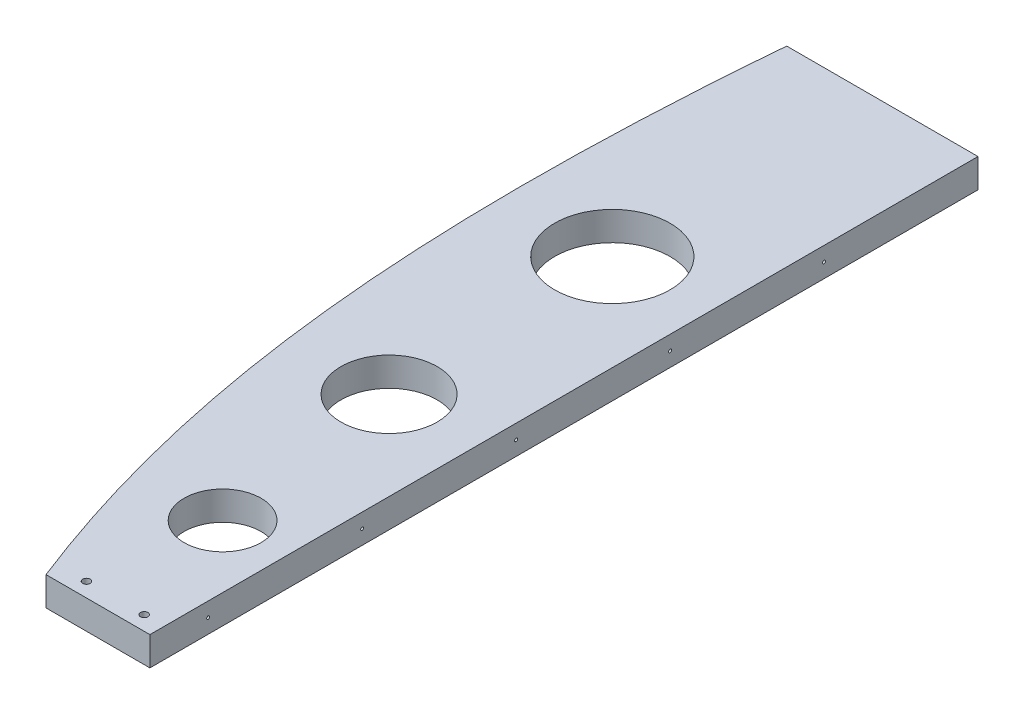
ISO-10303-21;
HEADER;
FILE_DESCRIPTION(('STEP AP214'),'2;1');
FILE_NAME('part.step','',(''),(''),'','','');
FILE_SCHEMA(('AUTOMOTIVE_DESIGN { 1 0 10303 214 1 1 1 1 }'));
ENDSEC;
DATA;
#1=APPLICATION_CONTEXT('core data for automotive mechanical design processes');
#2=APPLICATION_PROTOCOL_DEFINITION('international standard','automotive_design',2000,#1);
#3=PRODUCT_CONTEXT('',#1,'mechanical');
#4=PRODUCT('Part','Part','',(#3));
#5=PRODUCT_RELATED_PRODUCT_CATEGORY('part','',(#4));
#6=PRODUCT_DEFINITION_FORMATION('','',#4);
#7=PRODUCT_DEFINITION_CONTEXT('part definition',#1,'design');
#8=PRODUCT_DEFINITION('design','',#6,#7);
#9=PRODUCT_DEFINITION_SHAPE('','',#8);
#10=(LENGTH_UNIT() NAMED_UNIT(*) SI_UNIT(.MILLI.,.METRE.));
#11=(NAMED_UNIT(*) PLANE_ANGLE_UNIT() SI_UNIT($,.RADIAN.));
#12=(NAMED_UNIT(*) SI_UNIT($,.STERADIAN.) SOLID_ANGLE_UNIT());
#13=UNCERTAINTY_MEASURE_WITH_UNIT(LENGTH_MEASURE(1.E-05),#10,'distance_accuracy_value','');
#14=(GEOMETRIC_REPRESENTATION_CONTEXT(3) GLOBAL_UNCERTAINTY_ASSIGNED_CONTEXT((#13)) GLOBAL_UNIT_ASSIGNED_CONTEXT((#10,
#11,#12)) REPRESENTATION_CONTEXT('',''));
#15=CARTESIAN_POINT('',(0.,0.,0.));
#16=DIRECTION('',(0.,0.,1.));
#17=DIRECTION('',(1.,0.,0.));
#18=AXIS2_PLACEMENT_3D('',#15,#16,#17);
#19=CARTESIAN_POINT('',(-392.720476188398,5372.10000000001,2956.72721358892));
#20=DIRECTION('',(0.,1.,0.));
#21=DIRECTION('',(0.,0.,1.));
#22=AXIS2_PLACEMENT_3D('',#19,#20,#21);
#23=PLANE('',#22);
#24=CARTESIAN_POINT('',(-376.528681754696,5372.1,3220.41942707642));
#25=DIRECTION('',(0.,-1.,0.));
#26=DIRECTION('',(0.,0.,1.));
#27=AXIS2_PLACEMENT_3D('',#24,#25,#26);
#28=CIRCLE('',#27,2.45744999999997);
#29=CARTESIAN_POINT('',(-376.528681754696,5372.1,3222.87687707642));
#30=VERTEX_POINT('',#29);
#31=EDGE_CURVE('E437',#30,#30,#28,.T.);
#32=ORIENTED_EDGE('',*,*,#31,.F.);
#33=EDGE_LOOP('',(#32));
#34=FACE_BOUND('',#33,.T.);
#35=CARTESIAN_POINT('',(-338.428578956858,5372.1,3220.4194270765));
#36=DIRECTION('',(0.,-1.,0.));
#37=DIRECTION('',(0.,0.,1.));
#38=AXIS2_PLACEMENT_3D('',#35,#36,#37);
#39=CIRCLE('',#38,2.45744999999997);
#40=CARTESIAN_POINT('',(-338.428578956858,5372.1,3222.8768770765));
#41=VERTEX_POINT('',#40);
#42=EDGE_CURVE('E126',#41,#41,#39,.T.);
#43=ORIENTED_EDGE('',*,*,#42,.F.);
#44=EDGE_LOOP('',(#43));
#45=FACE_BOUND('',#44,.T.);
#46=CARTESIAN_POINT('',(-388.61999999999,5372.1,2861.31));
#47=DIRECTION('',(0.,-1.,0.));
#48=DIRECTION('',(1.,0.,0.));
#49=AXIS2_PLACEMENT_3D('',#46,#47,#48);
#50=CIRCLE('',#49,38.0999999999997);
#51=CARTESIAN_POINT('',(-350.51999999999,5372.1,2861.31));
#52=VERTEX_POINT('',#51);
#53=EDGE_CURVE('E166',#52,#52,#50,.T.);
#54=ORIENTED_EDGE('',*,*,#53,.F.);
#55=EDGE_LOOP('',(#54));
#56=FACE_BOUND('',#55,.T.);
#57=CARTESIAN_POINT('',(-383.53999999999,5372.1,3013.71));
#58=DIRECTION('',(0.,-1.,0.));
#59=DIRECTION('',(1.,0.,0.));
#60=AXIS2_PLACEMENT_3D('',#57,#58,#59);
#61=CIRCLE('',#60,31.75);
#62=CARTESIAN_POINT('',(-351.78999999999,5372.1,3013.71));
#63=VERTEX_POINT('',#62);
#64=EDGE_CURVE('E462',#63,#63,#61,.T.);
#65=ORIENTED_EDGE('',*,*,#64,.F.);
#66=EDGE_LOOP('',(#65));
#67=FACE_BOUND('',#66,.T.);
#68=CARTESIAN_POINT('',(-366.394999999991,5372.1,3140.71));
#69=DIRECTION('',(0.,-1.,0.));
#70=DIRECTION('',(1.,0.,0.));
#71=AXIS2_PLACEMENT_3D('',#68,#69,#70);
#72=CIRCLE('',#71,25.4);
#73=CARTESIAN_POINT('',(-340.994999999991,5372.1,3140.71));
#74=VERTEX_POINT('',#73);
#75=EDGE_CURVE('E179',#74,#74,#72,.T.);
#76=ORIENTED_EDGE('',*,*,#75,.F.);
#77=EDGE_LOOP('',(#76));
#78=FACE_BOUND('',#77,.T.);
#79=DIRECTION('',(0.,0.,1.));
#80=VECTOR('',#79,1.);
#81=CARTESIAN_POINT('',(-325.119999999999,5372.10000000001,2683.51));
#82=LINE('',#81,#80);
#83=CARTESIAN_POINT('',(-325.119999999999,5372.10000000001,2683.51));
#84=VERTEX_POINT('',#83);
#85=CARTESIAN_POINT('',(-325.119999999998,5372.1,3229.94442717783));
#86=VERTEX_POINT('',#85);
#87=EDGE_CURVE('E171',#84,#86,#82,.T.);
#88=ORIENTED_EDGE('',*,*,#87,.T.);
#89=DIRECTION('',(-1.,0.,0.));
#90=VECTOR('',#89,1.);
#91=CARTESIAN_POINT('',(-325.12,5372.1,3229.94442717783));
#92=LINE('',#91,#90);
#93=CARTESIAN_POINT('',(-393.682548612295,5372.1,3229.94442717783));
#94=VERTEX_POINT('',#93);
#95=EDGE_CURVE('E197',#86,#94,#92,.T.);
#96=ORIENTED_EDGE('',*,*,#95,.T.);
#97=CARTESIAN_POINT('',(-393.682548612295,5372.1,3229.94442717783));
#98=CARTESIAN_POINT('',(-394.456887278259,5372.10000000001,3227.97409267507));
#99=CARTESIAN_POINT('',(-395.224418386657,5372.10000000001,3226.00108202925));
#100=CARTESIAN_POINT('',(-396.745699742085,5372.10000000001,3222.04984801669));
#101=CARTESIAN_POINT('',(-397.499450552642,5372.10000000001,3220.07162486692));
#102=CARTESIAN_POINT('',(-398.993053269481,5372.10000000001,3216.10998577864));
#103=CARTESIAN_POINT('',(-399.732905469335,5372.10000000001,3214.12656995082));
#104=CARTESIAN_POINT('',(-401.198834415246,5372.10000000001,3210.1539474909));
#105=CARTESIAN_POINT('',(-401.924906766049,5372.10000000001,3208.16473923706));
#106=CARTESIAN_POINT('',(-403.362939318136,5372.10000000001,3204.18117724008));
#107=CARTESIAN_POINT('',(-404.074899215256,5372.10000000001,3202.18682338709));
#108=CARTESIAN_POINT('',(-405.484616665226,5372.10000000001,3198.19301213818));
#109=CARTESIAN_POINT('',(-406.182373587811,5372.1,3196.19355452019));
#110=CARTESIAN_POINT('',(-408.953173030685,5372.09999999999,3188.16137490409));
#111=CARTESIAN_POINT('',(-410.968400672618,5372.1,3182.10857083572));
#112=CARTESIAN_POINT('',(-414.867042059986,5372.10000000001,3169.9598314745));
#113=CARTESIAN_POINT('',(-416.750437957192,5372.10000000001,3163.86389046404));
#114=CARTESIAN_POINT('',(-420.384172507283,5372.10000000001,3151.63202096788));
#115=CARTESIAN_POINT('',(-422.134502345279,5372.10000000001,3145.49608986225));
#116=CARTESIAN_POINT('',(-425.501734798347,5372.10000000001,3133.18776982584));
#117=CARTESIAN_POINT('',(-427.118638031933,5372.10000000001,3127.01538106421));
#118=CARTESIAN_POINT('',(-430.22028975762,5372.10000000001,3114.6349025104));
#119=CARTESIAN_POINT('',(-431.704985678232,5372.10000000001,3108.42679955208));
#120=CARTESIAN_POINT('',(-434.542919092932,5372.10000000001,3095.98083496866));
#121=CARTESIAN_POINT('',(-435.896160515652,5372.10000000001,3089.74297423873));
#122=CARTESIAN_POINT('',(-438.473419996918,5372.10000000001,3077.24069251174));
#123=CARTESIAN_POINT('',(-439.697439319747,5372.10000000001,3070.97627177516));
#124=CARTESIAN_POINT('',(-442.019093536704,5372.10000000001,3058.4242371645));
#125=CARTESIAN_POINT('',(-443.11673095758,5372.1,3052.1366237567));
#126=CARTESIAN_POINT('',(-445.531902422019,5372.1,3037.45725662658));
#127=CARTESIAN_POINT('',(-446.802022602098,5372.10000000001,3029.05767164538));
#128=CARTESIAN_POINT('',(-449.133660073006,5372.10000000001,3012.22966620934));
#129=CARTESIAN_POINT('',(-450.195175381902,5372.10000000001,3003.80124548132));
#130=CARTESIAN_POINT('',(-452.119865470587,5372.10000000001,2986.92177852863));
#131=CARTESIAN_POINT('',(-452.98303844059,5372.10000000001,2978.47073209822));
#132=CARTESIAN_POINT('',(-454.521823137449,5372.10000000001,2961.55244648694));
#133=CARTESIAN_POINT('',(-455.197451604684,5372.10000000001,2953.08520881928));
#134=CARTESIAN_POINT('',(-456.37239496728,5372.10000000001,2936.13867906095));
#135=CARTESIAN_POINT('',(-456.871712957137,5372.10000000001,2927.65938718446));
#136=CARTESIAN_POINT('',(-457.496824621888,5372.10000000001,2914.93467998271));
#137=CARTESIAN_POINT('',(-457.684549513377,5372.10000000001,2910.69219806393));
#138=CARTESIAN_POINT('',(-458.020084952673,5372.10000000001,2902.20564766661));
#139=CARTESIAN_POINT('',(-458.167895578349,5372.1,2897.96157919117));
#140=CARTESIAN_POINT('',(-458.39261386685,5372.1,2890.54167375211));
#141=CARTESIAN_POINT('',(-458.478002740262,5372.10000000001,2887.36608909858));
#142=CARTESIAN_POINT('',(-458.627415596338,5372.10000000001,2881.01442207913));
#143=CARTESIAN_POINT('',(-458.691439622968,5372.10000000001,2877.83833971425));
#144=CARTESIAN_POINT('',(-458.798866254696,5372.10000000001,2871.48592736605));
#145=CARTESIAN_POINT('',(-458.842269506909,5372.10000000001,2868.30959739364));
#146=CARTESIAN_POINT('',(-458.909067808654,5372.10000000001,2861.95672988344));
#147=CARTESIAN_POINT('',(-458.9324628449,5372.10000000001,2858.78019234552));
#148=CARTESIAN_POINT('',(-458.973523832036,5372.10000000001,2849.25164706475));
#149=CARTESIAN_POINT('',(-458.962085713268,5372.10000000001,2842.8994936941));
#150=CARTESIAN_POINT('',(-458.865746069072,5372.10000000001,2830.19568475043));
#151=CARTESIAN_POINT('',(-458.780843498029,5372.1,2823.84402918579));
#152=CARTESIAN_POINT('',(-458.555440423178,5372.1,2811.90254793619));
#153=CARTESIAN_POINT('',(-458.422814807488,5372.10000000001,2806.31257153562));
#154=CARTESIAN_POINT('',(-458.105397741389,5372.10000000001,2795.13403521731));
#155=CARTESIAN_POINT('',(-457.920605650511,5372.10000000001,2789.54547531779));
#156=CARTESIAN_POINT('',(-457.500586546639,5372.10000000001,2778.37016686811));
#157=CARTESIAN_POINT('',(-457.265358727711,5372.10000000001,2772.78341834832));
#158=CARTESIAN_POINT('',(-456.745902375996,5372.10000000001,2761.61213595354));
#159=CARTESIAN_POINT('',(-456.461673251713,5372.10000000001,2756.0276021061));
#160=CARTESIAN_POINT('',(-455.845303056686,5372.10000000001,2744.86008184125));
#161=CARTESIAN_POINT('',(-455.513152591962,5372.10000000001,2739.27709594277));
#162=CARTESIAN_POINT('',(-454.801842865255,5372.10000000001,2728.11418570015));
#163=CARTESIAN_POINT('',(-454.422684125742,5372.10000000001,2722.53426132267));
#164=CARTESIAN_POINT('',(-453.617925963618,5372.10000000001,2711.3779283249));
#165=CARTESIAN_POINT('',(-453.192327964683,5372.10000000001,2705.80151960209));
#166=CARTESIAN_POINT('',(-452.519277338354,5372.10000000001,2697.4398551389));
#167=CARTESIAN_POINT('',(-452.289157668394,5372.10000000001,2694.65319423764));
#168=CARTESIAN_POINT('',(-451.817351920111,5372.10000000001,2689.08085188907));
#169=CARTESIAN_POINT('',(-451.5756658423,5372.10000000001,2686.29517044172));
#170=CARTESIAN_POINT('',(-451.328190233736,5372.10000000001,2683.51));
#171=B_SPLINE_CURVE_WITH_KNOTS('',3,(#97,#98,#99,#100,#101,#102,#103,#104,#105,#106,#107,#108,
#109,#110,#111,#112,#113,#114,#115,#116,#117,#118,#119,#120,#121,#122,#123,#124,#125,#126,#127,
#128,#129,#130,#131,#132,#133,#134,#135,#136,#137,#138,#139,#140,#141,#142,#143,#144,#145,#146,
#147,#148,#149,#150,#151,#152,#153,#154,#155,#156,#157,#158,#159,#160,#161,#162,#163,#164,#165,
#166,#167,#168,#169,#170),.UNSPECIFIED.,.F.,.F.,(4,2,2,2,2,2,2,2,2,2,2,2,2,2,2,2,2,2,2,2,2,2,2,
2,2,2,2,2,2,2,2,2,2,2,2,2,4),(0.,6.3510800999696,12.7018998972633,19.0525853991757,
25.4052635958807,31.7580785621484,38.1111748266914,57.2478936892731,76.387198412672,
95.5277699060871,114.66825266624,133.816312856681,152.963800614741,172.111101020311,
191.258018548431,216.74035075125,242.222925047359,267.705731851514,293.186263306885,
318.666347521117,331.40609726997,344.145822164442,353.675953643452,363.206065510394,
372.735878286334,382.265697390112,401.3216964695,420.377966775741,437.152367296033,
453.926973771488,470.701848315527,487.476925363986,504.255295296114,521.033478762763,
537.811148008956,546.199566113042,554.587983845862),.UNSPECIFIED.);
#172=CARTESIAN_POINT('',(-451.328190233736,5372.10000000001,2683.51));
#173=VERTEX_POINT('',#172);
#174=EDGE_CURVE('E184',#94,#173,#171,.T.);
#175=ORIENTED_EDGE('',*,*,#174,.T.);
#176=DIRECTION('',(1.,0.,0.));
#177=VECTOR('',#176,1.);
#178=CARTESIAN_POINT('',(-451.328190233736,5372.10000000001,2683.51));
#179=LINE('',#178,#177);
#180=EDGE_CURVE('E172',#173,#84,#179,.T.);
#181=ORIENTED_EDGE('',*,*,#180,.T.);
#182=EDGE_LOOP('',(#88,#96,#175,#181));
#183=FACE_BOUND('',#182,.T.);
#184=ADVANCED_FACE('F47',(#34,#45,#56,#67,#78,#183),#23,.F.);
#185=CARTESIAN_POINT('',(-325.12,5372.1,3229.94442717783));
#186=DIRECTION('',(0.,0.,1.));
#187=DIRECTION('',(-1.,0.,0.));
#188=AXIS2_PLACEMENT_3D('',#185,#186,#187);
#189=PLANE('',#188);
#190=DIRECTION('',(-1.,0.,0.));
#191=VECTOR('',#190,1.);
#192=CARTESIAN_POINT('',(-392.720476188398,5391.15,3229.94442717783));
#193=LINE('',#192,#191);
#194=CARTESIAN_POINT('',(-325.119999999998,5391.15,3229.94442717783));
#195=VERTEX_POINT('',#194);
#196=CARTESIAN_POINT('',(-393.682548612295,5391.15,3229.94442717783));
#197=VERTEX_POINT('',#196);
#198=EDGE_CURVE('E164',#195,#197,#193,.T.);
#199=ORIENTED_EDGE('',*,*,#198,.T.);
#200=DIRECTION('',(0.,-1.,0.));
#201=VECTOR('',#200,1.);
#202=CARTESIAN_POINT('',(-393.682548612297,5381.625,3229.94442717783));
#203=LINE('',#202,#201);
#204=EDGE_CURVE('E92',#197,#94,#203,.T.);
#205=ORIENTED_EDGE('',*,*,#204,.T.);
#206=ORIENTED_EDGE('',*,*,#95,.F.);
#207=DIRECTION('',(0.,1.,0.));
#208=VECTOR('',#207,1.);
#209=CARTESIAN_POINT('',(-325.12,5372.1,3229.94442717783));
#210=LINE('',#209,#208);
#211=EDGE_CURVE('E180',#86,#195,#210,.T.);
#212=ORIENTED_EDGE('',*,*,#211,.T.);
#213=EDGE_LOOP('',(#199,#205,#206,#212));
#214=FACE_BOUND('',#213,.T.);
#215=ADVANCED_FACE('F242',(#214),#189,.T.);
#216=CARTESIAN_POINT('',(-393.682548612295,5372.1,3229.94442717783));
#217=CARTESIAN_POINT('',(-393.682548612295,5391.15,3229.94442717783));
#218=CARTESIAN_POINT('',(-433.14097239304,5372.10000000001,3129.54068836821));
#219=CARTESIAN_POINT('',(-433.140972393041,5391.15000000001,3129.54068836821));
#220=CARTESIAN_POINT('',(-454.834742459102,5372.1,3022.43692802554));
#221=CARTESIAN_POINT('',(-454.834742459102,5391.15,3022.43692802554));
#222=CARTESIAN_POINT('',(-460.312828518179,5372.1,2819.19788970161));
#223=CARTESIAN_POINT('',(-460.312828518179,5391.15,2819.19788970161));
#224=CARTESIAN_POINT('',(-457.003208667205,5372.1,2747.37762040659));
#225=CARTESIAN_POINT('',(-457.003208667205,5391.15,2747.37762040659));
#226=CARTESIAN_POINT('',(-451.328190233736,5372.10000000001,2683.51));
#227=CARTESIAN_POINT('',(-451.328190233736,5391.15000000001,2683.51));
#228=B_SPLINE_SURFACE_WITH_KNOTS('',3,1,((#216,#217),(#218,#219),(#220,#221),(#222,#223),(#224,
#225),(#226,#227)),.UNSPECIFIED.,.F.,.F.,.F.,(4,2,4),(2,2),(-54.2493510406912,-24.5787816023228,
-9.05068072297407),(0.,1.90499999999997),.UNSPECIFIED.);
#229=CARTESIAN_POINT('',(-393.682548612295,5391.15,3229.94442717783));
#230=CARTESIAN_POINT('',(-394.456887278259,5391.15000000001,3227.97409267507));
#231=CARTESIAN_POINT('',(-395.224418386657,5391.15000000001,3226.00108202925));
#232=CARTESIAN_POINT('',(-396.745699742085,5391.15000000001,3222.0498480167));
#233=CARTESIAN_POINT('',(-397.499450552642,5391.15000000001,3220.07162486693));
#234=CARTESIAN_POINT('',(-398.993053269482,5391.15000000001,3216.10998577864));
#235=CARTESIAN_POINT('',(-399.732905469335,5391.15000000001,3214.12656995082));
#236=CARTESIAN_POINT('',(-401.198834415246,5391.15000000001,3210.1539474909));
#237=CARTESIAN_POINT('',(-401.924906766049,5391.15000000001,3208.16473923706));
#238=CARTESIAN_POINT('',(-403.362939318136,5391.15000000001,3204.18117724009));
#239=CARTESIAN_POINT('',(-404.074899215256,5391.15000000001,3202.18682338709));
#240=CARTESIAN_POINT('',(-405.484616665227,5391.15000000001,3198.19301213818));
#241=CARTESIAN_POINT('',(-406.182373587811,5391.15,3196.1935545202));
#242=CARTESIAN_POINT('',(-408.953173030686,5391.14999999999,3188.16137490409));
#243=CARTESIAN_POINT('',(-410.968400672618,5391.15000000001,3182.10857083572));
#244=CARTESIAN_POINT('',(-414.867042059986,5391.15000000001,3169.9598314745));
#245=CARTESIAN_POINT('',(-416.750437957192,5391.15000000001,3163.86389046404));
#246=CARTESIAN_POINT('',(-420.384172507283,5391.15000000001,3151.63202096789));
#247=CARTESIAN_POINT('',(-422.134502345279,5391.15000000001,3145.49608986225));
#248=CARTESIAN_POINT('',(-425.501734798347,5391.15000000001,3133.18776982584));
#249=CARTESIAN_POINT('',(-427.118638031933,5391.15000000001,3127.01538106421));
#250=CARTESIAN_POINT('',(-430.220289757621,5391.15000000001,3114.6349025104));
#251=CARTESIAN_POINT('',(-431.704985678232,5391.15000000001,3108.42679955208));
#252=CARTESIAN_POINT('',(-434.542919092932,5391.15000000001,3095.98083496866));
#253=CARTESIAN_POINT('',(-435.896160515652,5391.15000000001,3089.74297423873));
#254=CARTESIAN_POINT('',(-438.473419996918,5391.15000000001,3077.24069251174));
#255=CARTESIAN_POINT('',(-439.697439319747,5391.15000000001,3070.97627177516));
#256=CARTESIAN_POINT('',(-442.019093536705,5391.15000000001,3058.42423716449));
#257=CARTESIAN_POINT('',(-443.116730957581,5391.15,3052.1366237567));
#258=CARTESIAN_POINT('',(-445.53190242202,5391.15,3037.45725662658));
#259=CARTESIAN_POINT('',(-446.802022602099,5391.15000000001,3029.05767164538));
#260=CARTESIAN_POINT('',(-449.133660073006,5391.15000000001,3012.22966620934));
#261=CARTESIAN_POINT('',(-450.195175381901,5391.15000000001,3003.80124548132));
#262=CARTESIAN_POINT('',(-452.119865470587,5391.15000000001,2986.92177852863));
#263=CARTESIAN_POINT('',(-452.98303844059,5391.15000000001,2978.47073209822));
#264=CARTESIAN_POINT('',(-454.521823137448,5391.15000000001,2961.55244648694));
#265=CARTESIAN_POINT('',(-455.197451604683,5391.15000000001,2953.08520881929));
#266=CARTESIAN_POINT('',(-456.37239496728,5391.15000000001,2936.13867906095));
#267=CARTESIAN_POINT('',(-456.871712957137,5391.15000000001,2927.65938718446));
#268=CARTESIAN_POINT('',(-457.496824621887,5391.15000000001,2914.93467998271));
#269=CARTESIAN_POINT('',(-457.684549513377,5391.15000000001,2910.69219806393));
#270=CARTESIAN_POINT('',(-458.020084952673,5391.15000000001,2902.20564766661));
#271=CARTESIAN_POINT('',(-458.167895578347,5391.15,2897.96157919117));
#272=CARTESIAN_POINT('',(-458.392613866848,5391.15,2890.54167375211));
#273=CARTESIAN_POINT('',(-458.478002740261,5391.15000000001,2887.36608909858));
#274=CARTESIAN_POINT('',(-458.627415596337,5391.15000000001,2881.01442207913));
#275=CARTESIAN_POINT('',(-458.691439622968,5391.15000000001,2877.83833971425));
#276=CARTESIAN_POINT('',(-458.798866254696,5391.15000000001,2871.48592736605));
#277=CARTESIAN_POINT('',(-458.842269506908,5391.15000000001,2868.30959739364));
#278=CARTESIAN_POINT('',(-458.909067808653,5391.15000000001,2861.95672988344));
#279=CARTESIAN_POINT('',(-458.9324628449,5391.15000000001,2858.78019234552));
#280=CARTESIAN_POINT('',(-458.973523832035,5391.15000000001,2849.25164706475));
#281=CARTESIAN_POINT('',(-458.962085713268,5391.15000000001,2842.8994936941));
#282=CARTESIAN_POINT('',(-458.865746069071,5391.15000000001,2830.19568475043));
#283=CARTESIAN_POINT('',(-458.780843498028,5391.15,2823.8440291858));
#284=CARTESIAN_POINT('',(-458.555440423177,5391.15,2811.90254793619));
#285=CARTESIAN_POINT('',(-458.422814807487,5391.15000000001,2806.31257153562));
#286=CARTESIAN_POINT('',(-458.105397741389,5391.15000000001,2795.13403521731));
#287=CARTESIAN_POINT('',(-457.920605650511,5391.15000000001,2789.54547531779));
#288=CARTESIAN_POINT('',(-457.500586546639,5391.15000000001,2778.37016686811));
#289=CARTESIAN_POINT('',(-457.265358727711,5391.15000000001,2772.78341834832));
#290=CARTESIAN_POINT('',(-456.745902375996,5391.15000000001,2761.61213595354));
#291=CARTESIAN_POINT('',(-456.461673251713,5391.15000000001,2756.0276021061));
#292=CARTESIAN_POINT('',(-455.845303056686,5391.15000000001,2744.86008184125));
#293=CARTESIAN_POINT('',(-455.513152591962,5391.15000000001,2739.27709594277));
#294=CARTESIAN_POINT('',(-454.801842865254,5391.15000000001,2728.11418570015));
#295=CARTESIAN_POINT('',(-454.422684125742,5391.15000000001,2722.53426132267));
#296=CARTESIAN_POINT('',(-453.617925963618,5391.15000000001,2711.3779283249));
#297=CARTESIAN_POINT('',(-453.192327964683,5391.15000000001,2705.80151960208));
#298=CARTESIAN_POINT('',(-452.519277338354,5391.15000000001,2697.4398551389));
#299=CARTESIAN_POINT('',(-452.289157668393,5391.15000000001,2694.65319423764));
#300=CARTESIAN_POINT('',(-451.817351920111,5391.15000000001,2689.08085188907));
#301=CARTESIAN_POINT('',(-451.5756658423,5391.15000000001,2686.29517044172));
#302=CARTESIAN_POINT('',(-451.328190233736,5391.15000000001,2683.51));
#303=B_SPLINE_CURVE_WITH_KNOTS('',3,(#229,#230,#231,#232,#233,#234,#235,#236,#237,#238,#239,
#240,#241,#242,#243,#244,#245,#246,#247,#248,#249,#250,#251,#252,#253,#254,#255,#256,#257,#258,
#259,#260,#261,#262,#263,#264,#265,#266,#267,#268,#269,#270,#271,#272,#273,#274,#275,#276,#277,
#278,#279,#280,#281,#282,#283,#284,#285,#286,#287,#288,#289,#290,#291,#292,#293,#294,#295,#296,
#297,#298,#299,#300,#301,#302),.UNSPECIFIED.,.F.,.F.,(4,2,2,2,2,2,2,2,2,2,2,2,2,2,2,2,2,2,2,2,2,
2,2,2,2,2,2,2,2,2,2,2,2,2,2,2,4),(0.,6.35108009996999,12.7018998972633,19.0525853991763,
25.405263595881,31.7580785621488,38.1111748266919,57.247893689274,76.3871984126733,
95.5277699060879,114.668252666242,133.816312856684,152.963800614743,172.111101020314,
191.258018548434,216.740350751253,242.22292504736,267.705731851516,293.186263306887,
318.666347521119,331.406097269971,344.145822164443,353.675953643454,363.206065510395,
372.735878286335,382.265697390113,401.321696469502,420.377966775743,437.152367296035,
453.92697377149,470.701848315529,487.476925363988,504.255295296116,521.033478762765,
537.811148008959,546.199566113044,554.587983845864),.UNSPECIFIED.);
#304=CARTESIAN_POINT('',(-451.328190233736,5391.15000000001,2683.51));
#305=VERTEX_POINT('',#304);
#306=EDGE_CURVE('E161',#197,#305,#303,.T.);
#307=DIRECTION('',(0.,1.,0.));
#308=VECTOR('',#307,1.);
#309=CARTESIAN_POINT('',(-451.328190233736,5372.10000000001,2683.51));
#310=LINE('',#309,#308);
#311=EDGE_CURVE('E169',#305,#173,#310,.F.);
#312=ORIENTED_EDGE('',*,*,#306,.T.);
#313=ORIENTED_EDGE('',*,*,#311,.T.);
#314=ORIENTED_EDGE('',*,*,#174,.F.);
#315=ORIENTED_EDGE('',*,*,#204,.F.);
#316=EDGE_LOOP('',(#312,#313,#314,#315));
#317=FACE_BOUND('',#316,.T.);
#318=ADVANCED_FACE('F49',(#317),#228,.F.);
#319=CARTESIAN_POINT('',(-451.328190233736,5372.10000000001,2683.51));
#320=DIRECTION('',(0.,0.,-1.));
#321=DIRECTION('',(1.,0.,0.));
#322=AXIS2_PLACEMENT_3D('',#319,#320,#321);
#323=PLANE('',#322);
#324=CARTESIAN_POINT('',(-419.531342480863,5381.62500000001,2683.51));
#325=DIRECTION('',(0.,0.,1.));
#326=DIRECTION('',(1.,0.,0.));
#327=AXIS2_PLACEMENT_3D('',#324,#325,#326);
#328=CIRCLE('',#327,0.991870000000006);
#329=CARTESIAN_POINT('',(-418.539472480863,5381.62500000001,2683.51));
#330=VERTEX_POINT('',#329);
#331=EDGE_CURVE('E153',#330,#330,#328,.T.);
#332=ORIENTED_EDGE('',*,*,#331,.T.);
#333=EDGE_LOOP('',(#332));
#334=FACE_BOUND('',#333,.T.);
#335=CARTESIAN_POINT('',(-356.590447493622,5381.62500000001,2683.51));
#336=DIRECTION('',(0.,0.,1.));
#337=DIRECTION('',(1.,0.,0.));
#338=AXIS2_PLACEMENT_3D('',#335,#336,#337);
#339=CIRCLE('',#338,0.991870000000006);
#340=CARTESIAN_POINT('',(-355.598577493622,5381.62500000001,2683.51));
#341=VERTEX_POINT('',#340);
#342=EDGE_CURVE('E157',#341,#341,#339,.T.);
#343=ORIENTED_EDGE('',*,*,#342,.T.);
#344=EDGE_LOOP('',(#343));
#345=FACE_BOUND('',#344,.T.);
#346=DIRECTION('',(-1.,0.,0.));
#347=VECTOR('',#346,1.);
#348=CARTESIAN_POINT('',(-392.720476188398,5391.15000000001,2683.51));
#349=LINE('',#348,#347);
#350=CARTESIAN_POINT('',(-325.119999999998,5391.15000000001,2683.51));
#351=VERTEX_POINT('',#350);
#352=EDGE_CURVE('E158',#305,#351,#349,.F.);
#353=ORIENTED_EDGE('',*,*,#352,.T.);
#354=DIRECTION('',(0.,1.,0.));
#355=VECTOR('',#354,1.);
#356=CARTESIAN_POINT('',(-325.119999999999,5372.10000000001,2683.51));
#357=LINE('',#356,#355);
#358=EDGE_CURVE('E177',#351,#84,#357,.F.);
#359=ORIENTED_EDGE('',*,*,#358,.T.);
#360=ORIENTED_EDGE('',*,*,#180,.F.);
#361=ORIENTED_EDGE('',*,*,#311,.F.);
#362=EDGE_LOOP('',(#353,#359,#360,#361));
#363=FACE_BOUND('',#362,.T.);
#364=ADVANCED_FACE('F237',(#334,#345,#363),#323,.T.);
#365=CARTESIAN_POINT('',(-325.119999999999,5372.10000000001,2683.51));
#366=DIRECTION('',(1.,0.,0.));
#367=DIRECTION('',(0.,0.,1.));
#368=AXIS2_PLACEMENT_3D('',#365,#366,#367);
#369=PLANE('',#368);
#370=CARTESIAN_POINT('',(-325.119999999997,5381.625,2785.11));
#371=DIRECTION('',(-1.,0.,0.));
#372=DIRECTION('',(0.,0.,1.));
#373=AXIS2_PLACEMENT_3D('',#370,#371,#372);
#374=CIRCLE('',#373,0.991870000000006);
#375=CARTESIAN_POINT('',(-325.119999999997,5381.625,2786.10187));
#376=VERTEX_POINT('',#375);
#377=EDGE_CURVE('E54',#376,#376,#374,.T.);
#378=ORIENTED_EDGE('',*,*,#377,.T.);
#379=EDGE_LOOP('',(#378));
#380=FACE_BOUND('',#379,.T.);
#381=CARTESIAN_POINT('',(-325.12,5381.625,2886.71));
#382=DIRECTION('',(-1.,0.,0.));
#383=DIRECTION('',(0.,0.,1.));
#384=AXIS2_PLACEMENT_3D('',#381,#382,#383);
#385=CIRCLE('',#384,0.991870000000006);
#386=CARTESIAN_POINT('',(-325.12,5381.625,2887.70187));
#387=VERTEX_POINT('',#386);
#388=EDGE_CURVE('E137',#387,#387,#385,.T.);
#389=ORIENTED_EDGE('',*,*,#388,.T.);
#390=EDGE_LOOP('',(#389));
#391=FACE_BOUND('',#390,.T.);
#392=CARTESIAN_POINT('',(-325.119999999999,5381.625,2988.31));
#393=DIRECTION('',(-1.,0.,0.));
#394=DIRECTION('',(0.,0.,1.));
#395=AXIS2_PLACEMENT_3D('',#392,#393,#394);
#396=CIRCLE('',#395,0.991870000000006);
#397=CARTESIAN_POINT('',(-325.119999999999,5381.625,2989.30187));
#398=VERTEX_POINT('',#397);
#399=EDGE_CURVE('E141',#398,#398,#396,.T.);
#400=ORIENTED_EDGE('',*,*,#399,.T.);
#401=EDGE_LOOP('',(#400));
#402=FACE_BOUND('',#401,.T.);
#403=CARTESIAN_POINT('',(-325.119999999999,5381.62500000001,3089.91));
#404=DIRECTION('',(-1.,0.,0.));
#405=DIRECTION('',(0.,0.,1.));
#406=AXIS2_PLACEMENT_3D('',#403,#404,#405);
#407=CIRCLE('',#406,0.991870000000006);
#408=CARTESIAN_POINT('',(-325.119999999999,5381.62500000001,3090.90187));
#409=VERTEX_POINT('',#408);
#410=EDGE_CURVE('E145',#409,#409,#407,.T.);
#411=ORIENTED_EDGE('',*,*,#410,.T.);
#412=EDGE_LOOP('',(#411));
#413=FACE_BOUND('',#412,.T.);
#414=CARTESIAN_POINT('',(-325.119999999999,5381.625,3191.51));
#415=DIRECTION('',(-1.,0.,0.));
#416=DIRECTION('',(0.,0.,1.));
#417=AXIS2_PLACEMENT_3D('',#414,#415,#416);
#418=CIRCLE('',#417,0.991870000000006);
#419=CARTESIAN_POINT('',(-325.119999999999,5381.625,3192.50187));
#420=VERTEX_POINT('',#419);
#421=EDGE_CURVE('E149',#420,#420,#418,.T.);
#422=ORIENTED_EDGE('',*,*,#421,.T.);
#423=EDGE_LOOP('',(#422));
#424=FACE_BOUND('',#423,.T.);
#425=DIRECTION('',(0.,0.,1.));
#426=VECTOR('',#425,1.);
#427=CARTESIAN_POINT('',(-325.119999999998,5391.15000000001,2956.72721358892));
#428=LINE('',#427,#426);
#429=EDGE_CURVE('E69',#351,#195,#428,.T.);
#430=ORIENTED_EDGE('',*,*,#429,.T.);
#431=ORIENTED_EDGE('',*,*,#211,.F.);
#432=ORIENTED_EDGE('',*,*,#87,.F.);
#433=ORIENTED_EDGE('',*,*,#358,.F.);
#434=EDGE_LOOP('',(#430,#431,#432,#433));
#435=FACE_BOUND('',#434,.T.);
#436=ADVANCED_FACE('F233',(#380,#391,#402,#413,#424,#435),#369,.T.);
#437=CARTESIAN_POINT('',(-366.395000000001,5194.3,3140.71));
#438=DIRECTION('',(0.,1.,0.));
#439=DIRECTION('',(1.,0.,0.));
#440=AXIS2_PLACEMENT_3D('',#437,#438,#439);
#441=CYLINDRICAL_SURFACE('',#440,25.4);
#442=ORIENTED_EDGE('',*,*,#75,.T.);
#443=EDGE_LOOP('',(#442));
#444=FACE_BOUND('',#443,.T.);
#445=CARTESIAN_POINT('',(-366.394999999991,5391.15,3140.71));
#446=DIRECTION('',(0.,-1.,0.));
#447=DIRECTION('',(1.,0.,0.));
#448=AXIS2_PLACEMENT_3D('',#445,#446,#447);
#449=CIRCLE('',#448,25.4);
#450=CARTESIAN_POINT('',(-340.994999999991,5391.15,3140.71));
#451=VERTEX_POINT('',#450);
#452=EDGE_CURVE('E174',#451,#451,#449,.F.);
#453=ORIENTED_EDGE('',*,*,#452,.T.);
#454=EDGE_LOOP('',(#453));
#455=FACE_BOUND('',#454,.T.);
#456=ADVANCED_FACE('F229',(#444,#455),#441,.F.);
#457=CARTESIAN_POINT('',(-383.54,5194.3,3013.71));
#458=DIRECTION('',(0.,1.,0.));
#459=DIRECTION('',(1.,0.,0.));
#460=AXIS2_PLACEMENT_3D('',#457,#458,#459);
#461=CYLINDRICAL_SURFACE('',#460,31.75);
#462=ORIENTED_EDGE('',*,*,#64,.T.);
#463=EDGE_LOOP('',(#462));
#464=FACE_BOUND('',#463,.T.);
#465=CARTESIAN_POINT('',(-383.539999999991,5391.15,3013.71));
#466=DIRECTION('',(0.,-1.,0.));
#467=DIRECTION('',(1.,0.,0.));
#468=AXIS2_PLACEMENT_3D('',#465,#466,#467);
#469=CIRCLE('',#468,31.75);
#470=CARTESIAN_POINT('',(-351.789999999991,5391.15,3013.71));
#471=VERTEX_POINT('',#470);
#472=EDGE_CURVE('E60',#471,#471,#469,.F.);
#473=ORIENTED_EDGE('',*,*,#472,.T.);
#474=EDGE_LOOP('',(#473));
#475=FACE_BOUND('',#474,.T.);
#476=ADVANCED_FACE('F225',(#464,#475),#461,.F.);
#477=CARTESIAN_POINT('',(-388.619999999999,5194.3,2861.31));
#478=DIRECTION('',(0.,1.,0.));
#479=DIRECTION('',(1.,0.,0.));
#480=AXIS2_PLACEMENT_3D('',#477,#478,#479);
#481=CYLINDRICAL_SURFACE('',#480,38.0999999999997);
#482=ORIENTED_EDGE('',*,*,#53,.T.);
#483=EDGE_LOOP('',(#482));
#484=FACE_BOUND('',#483,.T.);
#485=CARTESIAN_POINT('',(-388.61999999999,5391.15,2861.31));
#486=DIRECTION('',(0.,-1.,0.));
#487=DIRECTION('',(1.,0.,0.));
#488=AXIS2_PLACEMENT_3D('',#485,#486,#487);
#489=CIRCLE('',#488,38.0999999999997);
#490=CARTESIAN_POINT('',(-350.51999999999,5391.15,2861.31));
#491=VERTEX_POINT('',#490);
#492=EDGE_CURVE('E13',#491,#491,#489,.F.);
#493=ORIENTED_EDGE('',*,*,#492,.T.);
#494=EDGE_LOOP('',(#493));
#495=FACE_BOUND('',#494,.T.);
#496=ADVANCED_FACE('F220',(#484,#495),#481,.F.);
#497=CARTESIAN_POINT('',(-392.720476188398,5391.15000000001,2956.72721358892));
#498=DIRECTION('',(0.,1.,0.));
#499=DIRECTION('',(0.,0.,1.));
#500=AXIS2_PLACEMENT_3D('',#497,#498,#499);
#501=PLANE('',#500);
#502=CARTESIAN_POINT('',(-376.528681754696,5391.15,3220.41942707642));
#503=DIRECTION('',(0.,-1.,0.));
#504=DIRECTION('',(0.,0.,1.));
#505=AXIS2_PLACEMENT_3D('',#502,#503,#504);
#506=CIRCLE('',#505,2.45744999999997);
#507=CARTESIAN_POINT('',(-376.528681754696,5391.15,3222.87687707642));
#508=VERTEX_POINT('',#507);
#509=EDGE_CURVE('E434',#508,#508,#506,.T.);
#510=ORIENTED_EDGE('',*,*,#509,.T.);
#511=EDGE_LOOP('',(#510));
#512=FACE_BOUND('',#511,.T.);
#513=CARTESIAN_POINT('',(-338.428578956858,5391.15,3220.41942707651));
#514=DIRECTION('',(0.,-1.,0.));
#515=DIRECTION('',(0.,0.,1.));
#516=AXIS2_PLACEMENT_3D('',#513,#514,#515);
#517=CIRCLE('',#516,2.45744999999997);
#518=CARTESIAN_POINT('',(-338.428578956858,5391.15,3222.87687707651));
#519=VERTEX_POINT('',#518);
#520=EDGE_CURVE('E131',#519,#519,#517,.T.);
#521=ORIENTED_EDGE('',*,*,#520,.T.);
#522=EDGE_LOOP('',(#521));
#523=FACE_BOUND('',#522,.T.);
#524=ORIENTED_EDGE('',*,*,#492,.F.);
#525=EDGE_LOOP('',(#524));
#526=FACE_BOUND('',#525,.T.);
#527=ORIENTED_EDGE('',*,*,#472,.F.);
#528=EDGE_LOOP('',(#527));
#529=FACE_BOUND('',#528,.T.);
#530=ORIENTED_EDGE('',*,*,#452,.F.);
#531=EDGE_LOOP('',(#530));
#532=FACE_BOUND('',#531,.T.);
#533=ORIENTED_EDGE('',*,*,#352,.F.);
#534=ORIENTED_EDGE('',*,*,#306,.F.);
#535=ORIENTED_EDGE('',*,*,#198,.F.);
#536=ORIENTED_EDGE('',*,*,#429,.F.);
#537=EDGE_LOOP('',(#533,#534,#535,#536));
#538=FACE_BOUND('',#537,.T.);
#539=ADVANCED_FACE('F214',(#512,#523,#526,#529,#532,#538),#501,.T.);
#540=CARTESIAN_POINT('',(-356.590447493622,5381.625,2702.56));
#541=DIRECTION('',(0.,0.,-1.));
#542=DIRECTION('',(1.,0.,0.));
#543=AXIS2_PLACEMENT_3D('',#540,#541,#542);
#544=CONICAL_SURFACE('',#543,0.991870000000006,1.02974425867677);
#545=CARTESIAN_POINT('',(-356.590447493622,5381.625,2703.15597562219));
#546=VERTEX_POINT('',#545);
#547=VERTEX_LOOP('',#546);
#548=FACE_BOUND('',#547,.T.);
#549=CARTESIAN_POINT('',(-356.590447493622,5381.625,2702.56));
#550=DIRECTION('',(0.,0.,1.));
#551=DIRECTION('',(1.,0.,0.));
#552=AXIS2_PLACEMENT_3D('',#549,#550,#551);
#553=CIRCLE('',#552,0.991870000000006);
#554=CARTESIAN_POINT('',(-355.598577493622,5381.625,2702.56));
#555=VERTEX_POINT('',#554);
#556=EDGE_CURVE('E154',#555,#555,#553,.T.);
#557=ORIENTED_EDGE('',*,*,#556,.F.);
#558=EDGE_LOOP('',(#557));
#559=FACE_BOUND('',#558,.T.);
#560=ADVANCED_FACE('F219',(#548,#559),#544,.F.);
#561=CARTESIAN_POINT('',(-356.590447493622,5381.625,2664.46));
#562=DIRECTION('',(0.,0.,-1.));
#563=DIRECTION('',(1.,0.,0.));
#564=AXIS2_PLACEMENT_3D('',#561,#562,#563);
#565=CYLINDRICAL_SURFACE('',#564,0.991870000000006);
#566=ORIENTED_EDGE('',*,*,#342,.F.);
#567=EDGE_LOOP('',(#566));
#568=FACE_BOUND('',#567,.T.);
#569=ORIENTED_EDGE('',*,*,#556,.T.);
#570=EDGE_LOOP('',(#569));
#571=FACE_BOUND('',#570,.T.);
#572=ADVANCED_FACE('F311',(#568,#571),#565,.F.);
#573=CARTESIAN_POINT('',(-419.531342480864,5381.625,2702.56));
#574=DIRECTION('',(0.,0.,-1.));
#575=DIRECTION('',(1.,0.,0.));
#576=AXIS2_PLACEMENT_3D('',#573,#574,#575);
#577=CONICAL_SURFACE('',#576,0.991870000000006,1.02974425867677);
#578=CARTESIAN_POINT('',(-419.531342480864,5381.625,2703.15597562219));
#579=VERTEX_POINT('',#578);
#580=VERTEX_LOOP('',#579);
#581=FACE_BOUND('',#580,.T.);
#582=CARTESIAN_POINT('',(-419.531342480864,5381.625,2702.56));
#583=DIRECTION('',(0.,0.,1.));
#584=DIRECTION('',(1.,0.,0.));
#585=AXIS2_PLACEMENT_3D('',#582,#583,#584);
#586=CIRCLE('',#585,0.991870000000006);
#587=CARTESIAN_POINT('',(-418.539472480864,5381.625,2702.56));
#588=VERTEX_POINT('',#587);
#589=EDGE_CURVE('E150',#588,#588,#586,.T.);
#590=ORIENTED_EDGE('',*,*,#589,.F.);
#591=EDGE_LOOP('',(#590));
#592=FACE_BOUND('',#591,.T.);
#593=ADVANCED_FACE('F308',(#581,#592),#577,.F.);
#594=CARTESIAN_POINT('',(-419.531342480864,5381.625,2664.46));
#595=DIRECTION('',(0.,0.,-1.));
#596=DIRECTION('',(1.,0.,0.));
#597=AXIS2_PLACEMENT_3D('',#594,#595,#596);
#598=CYLINDRICAL_SURFACE('',#597,0.991870000000006);
#599=ORIENTED_EDGE('',*,*,#331,.F.);
#600=EDGE_LOOP('',(#599));
#601=FACE_BOUND('',#600,.T.);
#602=ORIENTED_EDGE('',*,*,#589,.T.);
#603=EDGE_LOOP('',(#602));
#604=FACE_BOUND('',#603,.T.);
#605=ADVANCED_FACE('F304',(#601,#604),#598,.F.);
#606=CARTESIAN_POINT('',(-344.169999999999,5381.625,3191.51));
#607=DIRECTION('',(1.,0.,0.));
#608=DIRECTION('',(0.,0.,1.));
#609=AXIS2_PLACEMENT_3D('',#606,#607,#608);
#610=CONICAL_SURFACE('',#609,0.991870000000006,1.02974425867665);
#611=CARTESIAN_POINT('',(-344.765975622194,5381.625,3191.51));
#612=VERTEX_POINT('',#611);
#613=VERTEX_LOOP('',#612);
#614=FACE_BOUND('',#613,.T.);
#615=CARTESIAN_POINT('',(-344.169999999999,5381.625,3191.51));
#616=DIRECTION('',(-1.,0.,0.));
#617=DIRECTION('',(0.,0.,1.));
#618=AXIS2_PLACEMENT_3D('',#615,#616,#617);
#619=CIRCLE('',#618,0.991870000000006);
#620=CARTESIAN_POINT('',(-344.169999999999,5381.625,3192.50187));
#621=VERTEX_POINT('',#620);
#622=EDGE_CURVE('E146',#621,#621,#619,.T.);
#623=ORIENTED_EDGE('',*,*,#622,.F.);
#624=EDGE_LOOP('',(#623));
#625=FACE_BOUND('',#624,.T.);
#626=ADVANCED_FACE('F300',(#614,#625),#610,.F.);
#627=CARTESIAN_POINT('',(-312.42,5381.625,3191.51));
#628=DIRECTION('',(1.,0.,0.));
#629=DIRECTION('',(0.,0.,1.));
#630=AXIS2_PLACEMENT_3D('',#627,#628,#629);
#631=CYLINDRICAL_SURFACE('',#630,0.991870000000006);
#632=ORIENTED_EDGE('',*,*,#421,.F.);
#633=EDGE_LOOP('',(#632));
#634=FACE_BOUND('',#633,.T.);
#635=ORIENTED_EDGE('',*,*,#622,.T.);
#636=EDGE_LOOP('',(#635));
#637=FACE_BOUND('',#636,.T.);
#638=ADVANCED_FACE('F296',(#634,#637),#631,.F.);
#639=CARTESIAN_POINT('',(-344.169999999999,5381.62500000001,3089.91));
#640=DIRECTION('',(1.,0.,0.));
#641=DIRECTION('',(0.,0.,1.));
#642=AXIS2_PLACEMENT_3D('',#639,#640,#641);
#643=CONICAL_SURFACE('',#642,0.991870000000006,1.02974425867665);
#644=CARTESIAN_POINT('',(-344.765975622193,5381.62500000001,3089.91));
#645=VERTEX_POINT('',#644);
#646=VERTEX_LOOP('',#645);
#647=FACE_BOUND('',#646,.T.);
#648=CARTESIAN_POINT('',(-344.169999999999,5381.62500000001,3089.91));
#649=DIRECTION('',(-1.,0.,0.));
#650=DIRECTION('',(0.,0.,1.));
#651=AXIS2_PLACEMENT_3D('',#648,#649,#650);
#652=CIRCLE('',#651,0.991870000000006);
#653=CARTESIAN_POINT('',(-344.169999999999,5381.62500000001,3090.90187));
#654=VERTEX_POINT('',#653);
#655=EDGE_CURVE('E142',#654,#654,#652,.T.);
#656=ORIENTED_EDGE('',*,*,#655,.F.);
#657=EDGE_LOOP('',(#656));
#658=FACE_BOUND('',#657,.T.);
#659=ADVANCED_FACE('F292',(#647,#658),#643,.F.);
#660=CARTESIAN_POINT('',(-312.419999999999,5381.62500000001,3089.91));
#661=DIRECTION('',(1.,0.,0.));
#662=DIRECTION('',(0.,0.,1.));
#663=AXIS2_PLACEMENT_3D('',#660,#661,#662);
#664=CYLINDRICAL_SURFACE('',#663,0.991870000000006);
#665=ORIENTED_EDGE('',*,*,#410,.F.);
#666=EDGE_LOOP('',(#665));
#667=FACE_BOUND('',#666,.T.);
#668=ORIENTED_EDGE('',*,*,#655,.T.);
#669=EDGE_LOOP('',(#668));
#670=FACE_BOUND('',#669,.T.);
#671=ADVANCED_FACE('F288',(#667,#670),#664,.F.);
#672=CARTESIAN_POINT('',(-344.17,5381.625,2988.31));
#673=DIRECTION('',(1.,0.,0.));
#674=DIRECTION('',(0.,0.,1.));
#675=AXIS2_PLACEMENT_3D('',#672,#673,#674);
#676=CONICAL_SURFACE('',#675,0.991870000000006,1.02974425867665);
#677=CARTESIAN_POINT('',(-344.765975622194,5381.625,2988.31));
#678=VERTEX_POINT('',#677);
#679=VERTEX_LOOP('',#678);
#680=FACE_BOUND('',#679,.T.);
#681=CARTESIAN_POINT('',(-344.17,5381.625,2988.31));
#682=DIRECTION('',(-1.,0.,0.));
#683=DIRECTION('',(0.,0.,1.));
#684=AXIS2_PLACEMENT_3D('',#681,#682,#683);
#685=CIRCLE('',#684,0.991870000000006);
#686=CARTESIAN_POINT('',(-344.17,5381.625,2989.30187));
#687=VERTEX_POINT('',#686);
#688=EDGE_CURVE('E138',#687,#687,#685,.T.);
#689=ORIENTED_EDGE('',*,*,#688,.F.);
#690=EDGE_LOOP('',(#689));
#691=FACE_BOUND('',#690,.T.);
#692=ADVANCED_FACE('F282',(#680,#691),#676,.F.);
#693=CARTESIAN_POINT('',(-312.42,5381.625,2988.31));
#694=DIRECTION('',(1.,0.,0.));
#695=DIRECTION('',(0.,0.,1.));
#696=AXIS2_PLACEMENT_3D('',#693,#694,#695);
#697=CYLINDRICAL_SURFACE('',#696,0.991870000000006);
#698=ORIENTED_EDGE('',*,*,#399,.F.);
#699=EDGE_LOOP('',(#698));
#700=FACE_BOUND('',#699,.T.);
#701=ORIENTED_EDGE('',*,*,#688,.T.);
#702=EDGE_LOOP('',(#701));
#703=FACE_BOUND('',#702,.T.);
#704=ADVANCED_FACE('F276',(#700,#703),#697,.F.);
#705=CARTESIAN_POINT('',(-344.169999999999,5381.625,2886.71));
#706=DIRECTION('',(1.,0.,0.));
#707=DIRECTION('',(0.,0.,1.));
#708=AXIS2_PLACEMENT_3D('',#705,#706,#707);
#709=CONICAL_SURFACE('',#708,0.991870000000006,1.02974425867665);
#710=CARTESIAN_POINT('',(-344.765975622194,5381.625,2886.71));
#711=VERTEX_POINT('',#710);
#712=VERTEX_LOOP('',#711);
#713=FACE_BOUND('',#712,.T.);
#714=CARTESIAN_POINT('',(-344.169999999999,5381.625,2886.71));
#715=DIRECTION('',(-1.,0.,0.));
#716=DIRECTION('',(0.,0.,1.));
#717=AXIS2_PLACEMENT_3D('',#714,#715,#716);
#718=CIRCLE('',#717,0.991870000000006);
#719=CARTESIAN_POINT('',(-344.169999999999,5381.625,2887.70187));
#720=VERTEX_POINT('',#719);
#721=EDGE_CURVE('E129',#720,#720,#718,.T.);
#722=ORIENTED_EDGE('',*,*,#721,.F.);
#723=EDGE_LOOP('',(#722));
#724=FACE_BOUND('',#723,.T.);
#725=ADVANCED_FACE('F271',(#713,#724),#709,.F.);
#726=CARTESIAN_POINT('',(-312.42,5381.625,2886.71));
#727=DIRECTION('',(1.,0.,0.));
#728=DIRECTION('',(0.,0.,1.));
#729=AXIS2_PLACEMENT_3D('',#726,#727,#728);
#730=CYLINDRICAL_SURFACE('',#729,0.991870000000006);
#731=ORIENTED_EDGE('',*,*,#388,.F.);
#732=EDGE_LOOP('',(#731));
#733=FACE_BOUND('',#732,.T.);
#734=ORIENTED_EDGE('',*,*,#721,.T.);
#735=EDGE_LOOP('',(#734));
#736=FACE_BOUND('',#735,.T.);
#737=ADVANCED_FACE('F120',(#733,#736),#730,.F.);
#738=CARTESIAN_POINT('',(-344.169999999999,5381.625,2785.11));
#739=DIRECTION('',(1.,0.,0.));
#740=DIRECTION('',(0.,0.,1.));
#741=AXIS2_PLACEMENT_3D('',#738,#739,#740);
#742=CONICAL_SURFACE('',#741,0.991870000000006,1.02974425867665);
#743=CARTESIAN_POINT('',(-344.765975622194,5381.625,2785.11));
#744=VERTEX_POINT('',#743);
#745=VERTEX_LOOP('',#744);
#746=FACE_BOUND('',#745,.T.);
#747=CARTESIAN_POINT('',(-344.169999999999,5381.625,2785.11));
#748=DIRECTION('',(-1.,0.,0.));
#749=DIRECTION('',(0.,0.,1.));
#750=AXIS2_PLACEMENT_3D('',#747,#748,#749);
#751=CIRCLE('',#750,0.991870000000006);
#752=CARTESIAN_POINT('',(-344.169999999999,5381.625,2786.10187));
#753=VERTEX_POINT('',#752);
#754=EDGE_CURVE('E124',#753,#753,#751,.T.);
#755=ORIENTED_EDGE('',*,*,#754,.F.);
#756=EDGE_LOOP('',(#755));
#757=FACE_BOUND('',#756,.T.);
#758=ADVANCED_FACE('F116',(#746,#757),#742,.F.);
#759=CARTESIAN_POINT('',(-312.419999999999,5381.625,2785.11));
#760=DIRECTION('',(1.,0.,0.));
#761=DIRECTION('',(0.,0.,1.));
#762=AXIS2_PLACEMENT_3D('',#759,#760,#761);
#763=CYLINDRICAL_SURFACE('',#762,0.991870000000006);
#764=ORIENTED_EDGE('',*,*,#377,.F.);
#765=EDGE_LOOP('',(#764));
#766=FACE_BOUND('',#765,.T.);
#767=ORIENTED_EDGE('',*,*,#754,.T.);
#768=EDGE_LOOP('',(#767));
#769=FACE_BOUND('',#768,.T.);
#770=ADVANCED_FACE('F119',(#766,#769),#763,.F.);
#771=CARTESIAN_POINT('',(-338.428578956858,5391.15,3220.41942707651));
#772=DIRECTION('',(0.,1.,0.));
#773=DIRECTION('',(0.,0.,1.));
#774=AXIS2_PLACEMENT_3D('',#771,#772,#773);
#775=CYLINDRICAL_SURFACE('',#774,2.45744999999997);
#776=ORIENTED_EDGE('',*,*,#520,.F.);
#777=EDGE_LOOP('',(#776));
#778=FACE_BOUND('',#777,.T.);
#779=ORIENTED_EDGE('',*,*,#42,.T.);
#780=EDGE_LOOP('',(#779));
#781=FACE_BOUND('',#780,.T.);
#782=ADVANCED_FACE('F413',(#778,#781),#775,.F.);
#783=CARTESIAN_POINT('',(-376.528681754696,5391.15,3220.41942707642));
#784=DIRECTION('',(0.,1.,0.));
#785=DIRECTION('',(0.,0.,1.));
#786=AXIS2_PLACEMENT_3D('',#783,#784,#785);
#787=CYLINDRICAL_SURFACE('',#786,2.45744999999997);
#788=ORIENTED_EDGE('',*,*,#509,.F.);
#789=EDGE_LOOP('',(#788));
#790=FACE_BOUND('',#789,.T.);
#791=ORIENTED_EDGE('',*,*,#31,.T.);
#792=EDGE_LOOP('',(#791));
#793=FACE_BOUND('',#792,.T.);
#794=ADVANCED_FACE('F421',(#790,#793),#787,.F.);
#795=CLOSED_SHELL('',(#184,#215,#318,#364,#436,#456,#476,#496,#539,#560,#572,#593,#605,#626,
#638,#659,#671,#692,#704,#725,#737,#758,#770,#782,#794));
#796=MANIFOLD_SOLID_BREP('B2',#795);
#797=ADVANCED_BREP_SHAPE_REPRESENTATION('',(#18,#796),#14);
#798=SHAPE_DEFINITION_REPRESENTATION(#9,#797);
ENDSEC;
END-ISO-10303-21;
